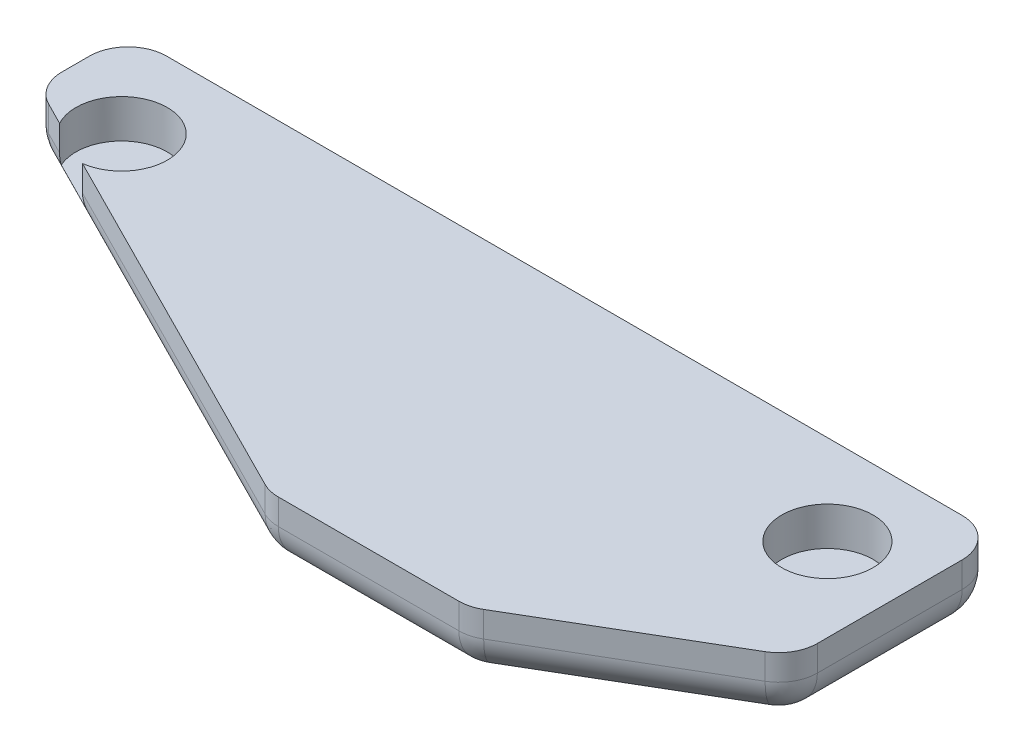
ISO-10303-21;
HEADER;
FILE_DESCRIPTION(('STEP AP214'),'2;1');
FILE_NAME('part.step','',(''),(''),'','','');
FILE_SCHEMA(('AUTOMOTIVE_DESIGN { 1 0 10303 214 1 1 1 1 }'));
ENDSEC;
DATA;
#1=APPLICATION_CONTEXT('core data for automotive mechanical design processes');
#2=APPLICATION_PROTOCOL_DEFINITION('international standard','automotive_design',2000,#1);
#3=PRODUCT_CONTEXT('',#1,'mechanical');
#4=PRODUCT('Part','Part','',(#3));
#5=PRODUCT_RELATED_PRODUCT_CATEGORY('part','',(#4));
#6=PRODUCT_DEFINITION_FORMATION('','',#4);
#7=PRODUCT_DEFINITION_CONTEXT('part definition',#1,'design');
#8=PRODUCT_DEFINITION('design','',#6,#7);
#9=PRODUCT_DEFINITION_SHAPE('','',#8);
#10=(LENGTH_UNIT() NAMED_UNIT(*) SI_UNIT(.MILLI.,.METRE.));
#11=(NAMED_UNIT(*) PLANE_ANGLE_UNIT() SI_UNIT($,.RADIAN.));
#12=(NAMED_UNIT(*) SI_UNIT($,.STERADIAN.) SOLID_ANGLE_UNIT());
#13=UNCERTAINTY_MEASURE_WITH_UNIT(LENGTH_MEASURE(1.E-05),#10,'distance_accuracy_value','');
#14=(GEOMETRIC_REPRESENTATION_CONTEXT(3) GLOBAL_UNCERTAINTY_ASSIGNED_CONTEXT((#13)) GLOBAL_UNIT_ASSIGNED_CONTEXT((#10,
#11,#12)) REPRESENTATION_CONTEXT('',''));
#15=CARTESIAN_POINT('',(0.,0.,0.));
#16=DIRECTION('',(0.,0.,1.));
#17=DIRECTION('',(1.,0.,0.));
#18=AXIS2_PLACEMENT_3D('',#15,#16,#17);
#19=CARTESIAN_POINT('',(-21.2161538362544,2.5,-8.24190342937014));
#20=DIRECTION('',(0.45113218265257,0.,-0.89245714394313));
#21=DIRECTION('',(-0.89245714394313,0.,-0.45113218265257));
#22=AXIS2_PLACEMENT_3D('',#19,#20,#21);
#23=PLANE('',#22);
#24=DIRECTION('',(0.89245714394313,0.,0.45113218265257));
#25=VECTOR('',#24,1.);
#26=CARTESIAN_POINT('',(-21.2161538362544,1.5,-8.24190342937014));
#27=LINE('',#26,#25);
#28=CARTESIAN_POINT('',(-17.7268239757059,1.5,-6.47806635700495));
#29=VERTEX_POINT('',#28);
#30=CARTESIAN_POINT('',(-3.33527557216229,1.5,0.796782286544548));
#31=VERTEX_POINT('',#30);
#32=EDGE_CURVE('E274',#29,#31,#27,.T.);
#33=ORIENTED_EDGE('',*,*,#32,.T.);
#34=DIRECTION('',(0.,-1.,0.));
#35=VECTOR('',#34,1.);
#36=CARTESIAN_POINT('',(-3.33527557216229,2.5,0.796782286544548));
#37=LINE('',#36,#35);
#38=CARTESIAN_POINT('',(-3.33527557216229,2.5,0.79678228654455));
#39=VERTEX_POINT('',#38);
#40=EDGE_CURVE('E277',#31,#39,#37,.F.);
#41=ORIENTED_EDGE('',*,*,#40,.T.);
#42=DIRECTION('',(0.89245714394313,0.,0.45113218265257));
#43=VECTOR('',#42,1.);
#44=CARTESIAN_POINT('',(-21.2161538362544,2.5,-8.24190342937014));
#45=LINE('',#44,#43);
#46=CARTESIAN_POINT('',(-17.7268239757059,2.5,-6.47806635700495));
#47=VERTEX_POINT('',#46);
#48=EDGE_CURVE('E196',#47,#39,#45,.T.);
#49=ORIENTED_EDGE('',*,*,#48,.F.);
#50=DIRECTION('',(0.,1.,0.));
#51=VECTOR('',#50,1.);
#52=CARTESIAN_POINT('',(-17.7268239757059,1.,-6.47806635700495));
#53=LINE('',#52,#51);
#54=EDGE_CURVE('E181',#47,#29,#53,.F.);
#55=ORIENTED_EDGE('',*,*,#54,.T.);
#56=EDGE_LOOP('',(#33,#41,#49,#55));
#57=FACE_BOUND('',#56,.T.);
#58=ADVANCED_FACE('F45',(#57),#23,.F.);
#59=CARTESIAN_POINT('',(-21.2161538362544,2.5,-11.7419034293701));
#60=DIRECTION('',(0.,0.,1.));
#61=DIRECTION('',(1.,0.,0.));
#62=AXIS2_PLACEMENT_3D('',#59,#60,#61);
#63=PLANE('',#62);
#64=DIRECTION('',(-1.,0.,0.));
#65=VECTOR('',#64,1.);
#66=CARTESIAN_POINT('',(-21.2161538362544,2.5,-11.7419034293701));
#67=LINE('',#66,#65);
#68=CARTESIAN_POINT('',(11.2838461637456,2.5,-11.7419034293701));
#69=VERTEX_POINT('',#68);
#70=CARTESIAN_POINT('',(-19.7161538362544,2.5,-11.7419034293701));
#71=VERTEX_POINT('',#70);
#72=EDGE_CURVE('E180',#69,#71,#67,.T.);
#73=ORIENTED_EDGE('',*,*,#72,.F.);
#74=DIRECTION('',(0.,-1.,0.));
#75=VECTOR('',#74,1.);
#76=CARTESIAN_POINT('',(11.2838461637456,2.5,-11.7419034293701));
#77=LINE('',#76,#75);
#78=CARTESIAN_POINT('',(11.2838461637456,1.5,-11.7419034293701));
#79=VERTEX_POINT('',#78);
#80=EDGE_CURVE('E11',#69,#79,#77,.T.);
#81=ORIENTED_EDGE('',*,*,#80,.T.);
#82=DIRECTION('',(-1.,0.,0.));
#83=VECTOR('',#82,1.);
#84=CARTESIAN_POINT('',(-21.2161538362544,1.5,-11.7419034293701));
#85=LINE('',#84,#83);
#86=CARTESIAN_POINT('',(-19.7161538362544,1.5,-11.7419034293701));
#87=VERTEX_POINT('',#86);
#88=EDGE_CURVE('E55',#79,#87,#85,.T.);
#89=ORIENTED_EDGE('',*,*,#88,.T.);
#90=DIRECTION('',(0.,-1.,0.));
#91=VECTOR('',#90,1.);
#92=CARTESIAN_POINT('',(-19.7161538362544,2.5,-11.7419034293701));
#93=LINE('',#92,#91);
#94=EDGE_CURVE('E479',#87,#71,#93,.F.);
#95=ORIENTED_EDGE('',*,*,#94,.T.);
#96=EDGE_LOOP('',(#73,#81,#89,#95));
#97=FACE_BOUND('',#96,.T.);
#98=ADVANCED_FACE('F364',(#97),#63,.F.);
#99=CARTESIAN_POINT('',(-21.2161538362544,2.5,-11.7419034293701));
#100=DIRECTION('',(1.,0.,0.));
#101=DIRECTION('',(0.,0.,-1.));
#102=AXIS2_PLACEMENT_3D('',#99,#100,#101);
#103=PLANE('',#102);
#104=DIRECTION('',(0.,0.,1.));
#105=VECTOR('',#104,1.);
#106=CARTESIAN_POINT('',(-21.2161538362544,1.5,-11.7419034293701));
#107=LINE('',#106,#105);
#108=CARTESIAN_POINT('',(-21.2161538362544,1.5,-10.2419034293701));
#109=VERTEX_POINT('',#108);
#110=CARTESIAN_POINT('',(-21.2161538362544,1.5,-9.16441464641701));
#111=VERTEX_POINT('',#110);
#112=EDGE_CURVE('E283',#109,#111,#107,.T.);
#113=ORIENTED_EDGE('',*,*,#112,.T.);
#114=DIRECTION('',(0.,-1.,0.));
#115=VECTOR('',#114,1.);
#116=CARTESIAN_POINT('',(-21.2161538362544,2.5,-9.16441464641701));
#117=LINE('',#116,#115);
#118=CARTESIAN_POINT('',(-21.2161538362544,2.5,-9.16441464641701));
#119=VERTEX_POINT('',#118);
#120=EDGE_CURVE('E286',#111,#119,#117,.F.);
#121=ORIENTED_EDGE('',*,*,#120,.T.);
#122=DIRECTION('',(0.,0.,1.));
#123=VECTOR('',#122,1.);
#124=CARTESIAN_POINT('',(-21.2161538362544,2.5,-11.7419034293701));
#125=LINE('',#124,#123);
#126=CARTESIAN_POINT('',(-21.2161538362544,2.5,-10.2419034293701));
#127=VERTEX_POINT('',#126);
#128=EDGE_CURVE('E220',#127,#119,#125,.T.);
#129=ORIENTED_EDGE('',*,*,#128,.F.);
#130=DIRECTION('',(0.,-1.,0.));
#131=VECTOR('',#130,1.);
#132=CARTESIAN_POINT('',(-21.2161538362544,2.5,-10.2419034293701));
#133=LINE('',#132,#131);
#134=EDGE_CURVE('E280',#127,#109,#133,.T.);
#135=ORIENTED_EDGE('',*,*,#134,.T.);
#136=EDGE_LOOP('',(#113,#121,#129,#135));
#137=FACE_BOUND('',#136,.T.);
#138=ADVANCED_FACE('F361',(#137),#103,.F.);
#139=DIRECTION('',(0.,-1.,0.));
#140=VECTOR('',#139,1.);
#141=CARTESIAN_POINT('',(-20.3928521102333,2.5,-7.82572893050231));
#142=LINE('',#141,#140);
#143=CARTESIAN_POINT('',(-20.3928521102333,2.5,-7.82572893050231));
#144=VERTEX_POINT('',#143);
#145=CARTESIAN_POINT('',(-20.3928521102333,1.5,-7.82572893050231));
#146=VERTEX_POINT('',#145);
#147=EDGE_CURVE('E269',#144,#146,#142,.T.);
#148=ORIENTED_EDGE('',*,*,#147,.T.);
#149=DIRECTION('',(0.89245714394313,0.,0.45113218265257));
#150=VECTOR('',#149,1.);
#151=CARTESIAN_POINT('',(-21.2161538362544,1.5,-8.24190342937014));
#152=LINE('',#151,#150);
#153=CARTESIAN_POINT('',(-19.5283652972646,1.5,-7.38873559647421));
#154=VERTEX_POINT('',#153);
#155=EDGE_CURVE('E175',#146,#154,#152,.T.);
#156=ORIENTED_EDGE('',*,*,#155,.T.);
#157=DIRECTION('',(0.,1.,0.));
#158=VECTOR('',#157,1.);
#159=CARTESIAN_POINT('',(-19.5283652972646,1.,-7.38873559647421));
#160=LINE('',#159,#158);
#161=CARTESIAN_POINT('',(-19.5283652972646,2.5,-7.38873559647421));
#162=VERTEX_POINT('',#161);
#163=EDGE_CURVE('E169',#154,#162,#160,.T.);
#164=ORIENTED_EDGE('',*,*,#163,.T.);
#165=EDGE_CURVE('E172',#144,#162,#45,.T.);
#166=ORIENTED_EDGE('',*,*,#165,.F.);
#167=EDGE_LOOP('',(#148,#156,#164,#166));
#168=FACE_BOUND('',#167,.T.);
#169=ADVANCED_FACE('F171',(#168),#23,.F.);
#170=CARTESIAN_POINT('',(-3.0161538362544,2.5,0.958096570629853));
#171=DIRECTION('',(0.,0.,-1.));
#172=DIRECTION('',(-1.,0.,0.));
#173=AXIS2_PLACEMENT_3D('',#170,#171,#172);
#174=PLANE('',#173);
#175=DIRECTION('',(1.,0.,0.));
#176=VECTOR('',#175,1.);
#177=CARTESIAN_POINT('',(-3.0161538362544,1.5,0.958096570629853));
#178=LINE('',#177,#176);
#179=CARTESIAN_POINT('',(-2.65857729818344,1.5,0.958096570629853));
#180=VERTEX_POINT('',#179);
#181=CARTESIAN_POINT('',(4.37582391861445,1.5,0.958096570629853));
#182=VERTEX_POINT('',#181);
#183=EDGE_CURVE('E243',#180,#182,#178,.T.);
#184=ORIENTED_EDGE('',*,*,#183,.T.);
#185=DIRECTION('',(0.,-1.,0.));
#186=VECTOR('',#185,1.);
#187=CARTESIAN_POINT('',(4.37582391861445,2.5,0.958096570629853));
#188=LINE('',#187,#186);
#189=CARTESIAN_POINT('',(4.37582391861445,2.5,0.958096570629853));
#190=VERTEX_POINT('',#189);
#191=EDGE_CURVE('E249',#182,#190,#188,.F.);
#192=ORIENTED_EDGE('',*,*,#191,.T.);
#193=DIRECTION('',(1.,0.,0.));
#194=VECTOR('',#193,1.);
#195=CARTESIAN_POINT('',(-3.0161538362544,2.5,0.958096570629853));
#196=LINE('',#195,#194);
#197=CARTESIAN_POINT('',(-2.65857729818344,2.5,0.958096570629853));
#198=VERTEX_POINT('',#197);
#199=EDGE_CURVE('E195',#198,#190,#196,.T.);
#200=ORIENTED_EDGE('',*,*,#199,.F.);
#201=DIRECTION('',(0.,-1.,0.));
#202=VECTOR('',#201,1.);
#203=CARTESIAN_POINT('',(-2.65857729818344,2.5,0.958096570629853));
#204=LINE('',#203,#202);
#205=EDGE_CURVE('E246',#198,#180,#204,.T.);
#206=ORIENTED_EDGE('',*,*,#205,.T.);
#207=EDGE_LOOP('',(#184,#192,#200,#206));
#208=FACE_BOUND('',#207,.T.);
#209=ADVANCED_FACE('F354',(#208),#174,.F.);
#210=CARTESIAN_POINT('',(4.78384616374559,2.5,0.958096570629853));
#211=DIRECTION('',(-0.506549048630865,0.,-0.862211146605729));
#212=DIRECTION('',(-0.862211146605729,0.,0.506549048630865));
#213=AXIS2_PLACEMENT_3D('',#210,#211,#212);
#214=PLANE('',#213);
#215=DIRECTION('',(0.862211146605729,0.,-0.506549048630865));
#216=VECTOR('',#215,1.);
#217=CARTESIAN_POINT('',(4.78384616374559,2.5,0.958096570629853));
#218=LINE('',#217,#216);
#219=CARTESIAN_POINT('',(5.13564749156075,2.5,0.751413290538446));
#220=VERTEX_POINT('',#219);
#221=CARTESIAN_POINT('',(12.0436697366919,2.5,-3.3070497784761));
#222=VERTEX_POINT('',#221);
#223=EDGE_CURVE('E225',#220,#222,#218,.T.);
#224=ORIENTED_EDGE('',*,*,#223,.F.);
#225=DIRECTION('',(0.,-1.,0.));
#226=VECTOR('',#225,1.);
#227=CARTESIAN_POINT('',(5.13564749156075,2.5,0.751413290538446));
#228=LINE('',#227,#226);
#229=CARTESIAN_POINT('',(5.13564749156075,1.5,0.751413290538446));
#230=VERTEX_POINT('',#229);
#231=EDGE_CURVE('E239',#220,#230,#228,.T.);
#232=ORIENTED_EDGE('',*,*,#231,.T.);
#233=DIRECTION('',(0.862211146605729,0.,-0.506549048630865));
#234=VECTOR('',#233,1.);
#235=CARTESIAN_POINT('',(4.78384616374559,1.5,0.958096570629853));
#236=LINE('',#235,#234);
#237=CARTESIAN_POINT('',(12.0436697366919,1.5,-3.3070497784761));
#238=VERTEX_POINT('',#237);
#239=EDGE_CURVE('E236',#230,#238,#236,.T.);
#240=ORIENTED_EDGE('',*,*,#239,.T.);
#241=DIRECTION('',(0.,-1.,0.));
#242=VECTOR('',#241,1.);
#243=CARTESIAN_POINT('',(12.0436697366919,2.5,-3.3070497784761));
#244=LINE('',#243,#242);
#245=EDGE_CURVE('E233',#238,#222,#244,.F.);
#246=ORIENTED_EDGE('',*,*,#245,.T.);
#247=EDGE_LOOP('',(#224,#232,#240,#246));
#248=FACE_BOUND('',#247,.T.);
#249=ADVANCED_FACE('F350',(#248),#214,.F.);
#250=CARTESIAN_POINT('',(12.7838461637456,2.5,-3.74190342937014));
#251=DIRECTION('',(-1.,0.,0.));
#252=DIRECTION('',(0.,0.,1.));
#253=AXIS2_PLACEMENT_3D('',#250,#251,#252);
#254=PLANE('',#253);
#255=DIRECTION('',(0.,0.,-1.));
#256=VECTOR('',#255,1.);
#257=CARTESIAN_POINT('',(12.7838461637456,2.5,-3.74190342937014));
#258=LINE('',#257,#256);
#259=CARTESIAN_POINT('',(12.7838461637456,2.5,-4.60036649838469));
#260=VERTEX_POINT('',#259);
#261=CARTESIAN_POINT('',(12.7838461637456,2.5,-10.2419034293701));
#262=VERTEX_POINT('',#261);
#263=EDGE_CURVE('E229',#260,#262,#258,.T.);
#264=ORIENTED_EDGE('',*,*,#263,.F.);
#265=DIRECTION('',(0.,-1.,0.));
#266=VECTOR('',#265,1.);
#267=CARTESIAN_POINT('',(12.7838461637456,2.5,-4.60036649838469));
#268=LINE('',#267,#266);
#269=CARTESIAN_POINT('',(12.7838461637456,1.5,-4.60036649838469));
#270=VERTEX_POINT('',#269);
#271=EDGE_CURVE('E481',#260,#270,#268,.T.);
#272=ORIENTED_EDGE('',*,*,#271,.T.);
#273=DIRECTION('',(0.,0.,-1.));
#274=VECTOR('',#273,1.);
#275=CARTESIAN_POINT('',(12.7838461637456,1.5,-3.74190342937014));
#276=LINE('',#275,#274);
#277=CARTESIAN_POINT('',(12.7838461637456,1.5,-10.2419034293701));
#278=VERTEX_POINT('',#277);
#279=EDGE_CURVE('E486',#270,#278,#276,.T.);
#280=ORIENTED_EDGE('',*,*,#279,.T.);
#281=DIRECTION('',(0.,-1.,0.));
#282=VECTOR('',#281,1.);
#283=CARTESIAN_POINT('',(12.7838461637456,2.5,-10.2419034293701));
#284=LINE('',#283,#282);
#285=EDGE_CURVE('E526',#278,#262,#284,.F.);
#286=ORIENTED_EDGE('',*,*,#285,.T.);
#287=EDGE_LOOP('',(#264,#272,#280,#286));
#288=FACE_BOUND('',#287,.T.);
#289=ADVANCED_FACE('F344',(#288),#254,.F.);
#290=CARTESIAN_POINT('',(0.,2.5,0.));
#291=DIRECTION('',(0.,1.,0.));
#292=DIRECTION('',(0.,0.,1.));
#293=AXIS2_PLACEMENT_3D('',#290,#291,#292);
#294=PLANE('',#293);
#295=ORIENTED_EDGE('',*,*,#199,.T.);
#296=CARTESIAN_POINT('',(4.37582391861445,2.5,-0.541903429370147));
#297=DIRECTION('',(0.,1.,0.));
#298=DIRECTION('',(0.,0.,1.));
#299=AXIS2_PLACEMENT_3D('',#296,#297,#298);
#300=CIRCLE('',#299,1.5);
#301=EDGE_CURVE('E266',#190,#220,#300,.T.);
#302=ORIENTED_EDGE('',*,*,#301,.T.);
#303=ORIENTED_EDGE('',*,*,#223,.T.);
#304=CARTESIAN_POINT('',(11.2838461637456,2.5,-4.60036649838469));
#305=DIRECTION('',(0.,1.,0.));
#306=DIRECTION('',(0.,0.,1.));
#307=AXIS2_PLACEMENT_3D('',#304,#305,#306);
#308=CIRCLE('',#307,1.5);
#309=EDGE_CURVE('E260',#222,#260,#308,.T.);
#310=ORIENTED_EDGE('',*,*,#309,.T.);
#311=ORIENTED_EDGE('',*,*,#263,.T.);
#312=CARTESIAN_POINT('',(11.2838461637456,2.5,-10.2419034293701));
#313=DIRECTION('',(0.,1.,0.));
#314=DIRECTION('',(0.,0.,1.));
#315=AXIS2_PLACEMENT_3D('',#312,#313,#314);
#316=CIRCLE('',#315,1.5);
#317=EDGE_CURVE('E257',#262,#69,#316,.T.);
#318=ORIENTED_EDGE('',*,*,#317,.T.);
#319=ORIENTED_EDGE('',*,*,#72,.T.);
#320=CARTESIAN_POINT('',(-19.7161538362544,2.5,-10.2419034293701));
#321=DIRECTION('',(0.,1.,0.));
#322=DIRECTION('',(0.,0.,1.));
#323=AXIS2_PLACEMENT_3D('',#320,#321,#322);
#324=CIRCLE('',#323,1.5);
#325=EDGE_CURVE('E252',#71,#127,#324,.T.);
#326=ORIENTED_EDGE('',*,*,#325,.T.);
#327=ORIENTED_EDGE('',*,*,#128,.T.);
#328=CARTESIAN_POINT('',(-19.7161538362544,2.5,-9.16441464641701));
#329=DIRECTION('',(0.,1.,0.));
#330=DIRECTION('',(0.,0.,1.));
#331=AXIS2_PLACEMENT_3D('',#328,#329,#330);
#332=CIRCLE('',#331,1.5);
#333=EDGE_CURVE('E193',#119,#144,#332,.T.);
#334=ORIENTED_EDGE('',*,*,#333,.T.);
#335=ORIENTED_EDGE('',*,*,#165,.T.);
#336=CARTESIAN_POINT('',(-17.9661538362544,2.5,-8.24190342937014));
#337=DIRECTION('',(0.,1.,0.));
#338=DIRECTION('',(0.,0.,1.));
#339=AXIS2_PLACEMENT_3D('',#336,#337,#338);
#340=CIRCLE('',#339,1.78);
#341=EDGE_CURVE('E189',#47,#162,#340,.T.);
#342=ORIENTED_EDGE('',*,*,#341,.F.);
#343=ORIENTED_EDGE('',*,*,#48,.T.);
#344=CARTESIAN_POINT('',(-2.65857729818344,2.5,-0.541903429370147));
#345=DIRECTION('',(0.,1.,0.));
#346=DIRECTION('',(0.,0.,1.));
#347=AXIS2_PLACEMENT_3D('',#344,#345,#346);
#348=CIRCLE('',#347,1.5);
#349=EDGE_CURVE('E263',#39,#198,#348,.T.);
#350=ORIENTED_EDGE('',*,*,#349,.T.);
#351=EDGE_LOOP('',(#295,#302,#303,#310,#311,#318,#319,#326,#327,#334,#335,#342,#343,#350));
#352=FACE_BOUND('',#351,.T.);
#353=CARTESIAN_POINT('',(9.53384616374559,2.5,-8.24190342937015));
#354=DIRECTION('',(0.,1.,0.));
#355=DIRECTION('',(0.,0.,-1.));
#356=AXIS2_PLACEMENT_3D('',#353,#354,#355);
#357=CIRCLE('',#356,1.78);
#358=CARTESIAN_POINT('',(9.53384616374559,2.5,-10.0219034293702));
#359=VERTEX_POINT('',#358);
#360=EDGE_CURVE('E202',#359,#359,#357,.T.);
#361=ORIENTED_EDGE('',*,*,#360,.F.);
#362=EDGE_LOOP('',(#361));
#363=FACE_BOUND('',#362,.T.);
#364=ADVANCED_FACE('F186',(#352,#363),#294,.T.);
#365=CARTESIAN_POINT('',(0.,0.,0.));
#366=DIRECTION('',(0.,1.,0.));
#367=DIRECTION('',(0.,0.,1.));
#368=AXIS2_PLACEMENT_3D('',#365,#366,#367);
#369=PLANE('',#368);
#370=DIRECTION('',(0.89245714394313,0.,0.45113218265257));
#371=VECTOR('',#370,1.);
#372=CARTESIAN_POINT('',(-0.322895239743455,0.,0.638771017753357));
#373=LINE('',#372,#371);
#374=CARTESIAN_POINT('',(-2.65857729818344,0.,-0.541903429370147));
#375=VERTEX_POINT('',#374);
#376=CARTESIAN_POINT('',(-19.7161538362544,0.,-9.16441464641701));
#377=VERTEX_POINT('',#376);
#378=EDGE_CURVE('E301',#375,#377,#373,.F.);
#379=ORIENTED_EDGE('',*,*,#378,.T.);
#380=DIRECTION('',(0.,0.,1.));
#381=VECTOR('',#380,1.);
#382=CARTESIAN_POINT('',(-19.7161538362544,0.,0.));
#383=LINE('',#382,#381);
#384=CARTESIAN_POINT('',(-19.7161538362544,0.,-10.2419034293701));
#385=VERTEX_POINT('',#384);
#386=EDGE_CURVE('E304',#377,#385,#383,.F.);
#387=ORIENTED_EDGE('',*,*,#386,.T.);
#388=DIRECTION('',(-1.,0.,0.));
#389=VECTOR('',#388,1.);
#390=CARTESIAN_POINT('',(0.,0.,-10.2419034293701));
#391=LINE('',#390,#389);
#392=CARTESIAN_POINT('',(11.2838461637456,0.,-10.2419034293701));
#393=VERTEX_POINT('',#392);
#394=EDGE_CURVE('E289',#385,#393,#391,.F.);
#395=ORIENTED_EDGE('',*,*,#394,.T.);
#396=DIRECTION('',(0.,0.,-1.));
#397=VECTOR('',#396,1.);
#398=CARTESIAN_POINT('',(11.2838461637456,0.,0.));
#399=LINE('',#398,#397);
#400=CARTESIAN_POINT('',(11.2838461637456,0.,-4.60036649838469));
#401=VERTEX_POINT('',#400);
#402=EDGE_CURVE('E292',#393,#401,#399,.F.);
#403=ORIENTED_EDGE('',*,*,#402,.T.);
#404=DIRECTION('',(0.862211146605729,0.,-0.506549048630865));
#405=VECTOR('',#404,1.);
#406=CARTESIAN_POINT('',(0.886123608059888,0.,1.50829550308066));
#407=LINE('',#406,#405);
#408=CARTESIAN_POINT('',(4.37582391861446,0.,-0.541903429370147));
#409=VERTEX_POINT('',#408);
#410=EDGE_CURVE('E295',#401,#409,#407,.F.);
#411=ORIENTED_EDGE('',*,*,#410,.T.);
#412=DIRECTION('',(1.,0.,0.));
#413=VECTOR('',#412,1.);
#414=CARTESIAN_POINT('',(0.,0.,-0.541903429370147));
#415=LINE('',#414,#413);
#416=EDGE_CURVE('E298',#409,#375,#415,.F.);
#417=ORIENTED_EDGE('',*,*,#416,.T.);
#418=EDGE_LOOP('',(#379,#387,#395,#403,#411,#417));
#419=FACE_BOUND('',#418,.T.);
#420=ADVANCED_FACE('F337',(#419),#369,.F.);
#421=CARTESIAN_POINT('',(9.53384616374559,1.,-8.24190342937015));
#422=DIRECTION('',(0.,1.,0.));
#423=DIRECTION('',(0.,0.,1.));
#424=AXIS2_PLACEMENT_3D('',#421,#422,#423);
#425=CYLINDRICAL_SURFACE('',#424,1.78);
#426=CARTESIAN_POINT('',(9.53384616374559,1.,-8.24190342937015));
#427=DIRECTION('',(0.,1.,0.));
#428=DIRECTION('',(0.,0.,-1.));
#429=AXIS2_PLACEMENT_3D('',#426,#427,#428);
#430=CIRCLE('',#429,1.78);
#431=CARTESIAN_POINT('',(9.53384616374559,1.,-10.0219034293702));
#432=VERTEX_POINT('',#431);
#433=EDGE_CURVE('E209',#432,#432,#430,.T.);
#434=ORIENTED_EDGE('',*,*,#433,.F.);
#435=EDGE_LOOP('',(#434));
#436=FACE_BOUND('',#435,.T.);
#437=ORIENTED_EDGE('',*,*,#360,.T.);
#438=EDGE_LOOP('',(#437));
#439=FACE_BOUND('',#438,.T.);
#440=ADVANCED_FACE('F332',(#436,#439),#425,.F.);
#441=CARTESIAN_POINT('',(9.53384616374559,1.,-8.24190342937015));
#442=DIRECTION('',(0.,-1.,0.));
#443=DIRECTION('',(0.,0.,-1.));
#444=AXIS2_PLACEMENT_3D('',#441,#442,#443);
#445=PLANE('',#444);
#446=ORIENTED_EDGE('',*,*,#433,.T.);
#447=EDGE_LOOP('',(#446));
#448=FACE_BOUND('',#447,.T.);
#449=ADVANCED_FACE('F336',(#448),#445,.F.);
#450=CARTESIAN_POINT('',(-17.9661538362544,1.,-8.24190342937014));
#451=DIRECTION('',(0.,1.,0.));
#452=DIRECTION('',(0.,0.,1.));
#453=AXIS2_PLACEMENT_3D('',#450,#451,#452);
#454=PLANE('',#453);
#455=CARTESIAN_POINT('',(-17.9661538362544,1.,-8.24190342937014));
#456=DIRECTION('',(0.,1.,0.));
#457=DIRECTION('',(0.,0.,1.));
#458=AXIS2_PLACEMENT_3D('',#455,#456,#457);
#459=CIRCLE('',#458,1.78);
#460=CARTESIAN_POINT('',(-17.5859549230477,1.,-6.50298169841258));
#461=VERTEX_POINT('',#460);
#462=CARTESIAN_POINT('',(-19.5918323042256,1.,-7.5169416932937));
#463=VERTEX_POINT('',#462);
#464=EDGE_CURVE('E201',#461,#463,#459,.T.);
#465=ORIENTED_EDGE('',*,*,#464,.T.);
#466=DIRECTION('',(0.89245714394313,0.,0.45113218265257));
#467=VECTOR('',#466,1.);
#468=CARTESIAN_POINT('',(-19.5918323042256,1.,-7.5169416932937));
#469=LINE('',#468,#467);
#470=EDGE_CURVE('E528',#463,#461,#469,.T.);
#471=ORIENTED_EDGE('',*,*,#470,.T.);
#472=EDGE_LOOP('',(#465,#471));
#473=FACE_BOUND('',#472,.T.);
#474=ADVANCED_FACE('F331',(#473),#454,.T.);
#475=CARTESIAN_POINT('',(-17.9661538362544,1.,-8.24190342937014));
#476=DIRECTION('',(0.,1.,0.));
#477=DIRECTION('',(0.,0.,1.));
#478=AXIS2_PLACEMENT_3D('',#475,#476,#477);
#479=CYLINDRICAL_SURFACE('',#478,1.78);
#480=ORIENTED_EDGE('',*,*,#163,.F.);
#481=CARTESIAN_POINT('',(-19.5283652972646,1.5,-7.38873559647421));
#482=CARTESIAN_POINT('',(-19.5283498465747,1.47074552603865,-7.38872143142233));
#483=CARTESIAN_POINT('',(-19.5290894053926,1.44151983206224,-7.39006104318176));
#484=CARTESIAN_POINT('',(-19.5319444765223,1.38341945308011,-7.39531351335046));
#485=CARTESIAN_POINT('',(-19.5340574915417,1.35454422771325,-7.39922170157816));
#486=CARTESIAN_POINT('',(-19.5421485329608,1.26989717116672,-7.41439562403726));
#487=CARTESIAN_POINT('',(-19.5498898107216,1.21488669993309,-7.42912296226892));
#488=CARTESIAN_POINT('',(-19.5638964373973,1.1338759659634,-7.45721799023324));
#489=CARTESIAN_POINT('',(-19.5690813367443,1.10664643440959,-7.46783375151531));
#490=CARTESIAN_POINT('',(-19.5800646688608,1.05279034263849,-7.49099730337504));
#491=CARTESIAN_POINT('',(-19.5858690438116,1.02617328342096,-7.50356445289218));
#492=CARTESIAN_POINT('',(-19.5918323042256,0.999999999999999,-7.5169416932937));
#493=B_SPLINE_CURVE_WITH_KNOTS('',3,(#481,#482,#483,#484,#485,#486,#487,#488,#489,#490,#491,
#492),.UNSPECIFIED.,.F.,.F.,(4,2,2,2,2,4),(0.,0.0876723938858805,0.175185821325527,
0.346622194866518,0.435616579129443,0.525558069883932),.UNSPECIFIED.);
#494=EDGE_CURVE('E317',#154,#463,#493,.T.);
#495=ORIENTED_EDGE('',*,*,#494,.T.);
#496=ORIENTED_EDGE('',*,*,#464,.F.);
#497=CARTESIAN_POINT('',(-17.5859549230477,1.,-6.50298169841258));
#498=CARTESIAN_POINT('',(-17.6138620441677,1.05088183919257,-6.49688090000058));
#499=CARTESIAN_POINT('',(-17.6389894085062,1.10388191376363,-6.49210111301803));
#500=CARTESIAN_POINT('',(-17.6805497682988,1.21188582704635,-6.48483897854557));
#501=CARTESIAN_POINT('',(-17.6971681678232,1.26681629088524,-6.48230666951094));
#502=CARTESIAN_POINT('',(-17.71454667096,1.35178701982175,-6.47976561987795));
#503=CARTESIAN_POINT('',(-17.7190893853302,1.38102662509103,-6.4791287339435));
#504=CARTESIAN_POINT('',(-17.7252579707664,1.44016870993831,-6.47827846080434));
#505=CARTESIAN_POINT('',(-17.7268483432449,1.47007493545149,-6.47807022443014));
#506=CARTESIAN_POINT('',(-17.7268239757059,1.5,-6.47806635700495));
#507=B_SPLINE_CURVE_WITH_KNOTS('',3,(#497,#498,#499,#500,#501,#502,#503,#504,#505,#506),
.UNSPECIFIED.,.F.,.F.,(4,2,2,2,4),(0.,0.175557698971989,0.3471072241234,0.435749928595007,
0.525451725840333),.UNSPECIFIED.);
#508=EDGE_CURVE('E308',#461,#29,#507,.T.);
#509=ORIENTED_EDGE('',*,*,#508,.T.);
#510=ORIENTED_EDGE('',*,*,#54,.F.);
#511=ORIENTED_EDGE('',*,*,#341,.T.);
#512=EDGE_LOOP('',(#480,#495,#496,#509,#510,#511));
#513=FACE_BOUND('',#512,.T.);
#514=ADVANCED_FACE('F198',(#513),#479,.F.);
#515=CARTESIAN_POINT('',(-19.7161538362544,2.5,-10.2419034293701));
#516=DIRECTION('',(0.,-1.,0.));
#517=DIRECTION('',(0.,0.,-1.));
#518=AXIS2_PLACEMENT_3D('',#515,#516,#517);
#519=CYLINDRICAL_SURFACE('',#518,1.5);
#520=CARTESIAN_POINT('',(-19.7161538362544,1.5,-10.2419034293701));
#521=DIRECTION('',(0.,-1.,0.));
#522=DIRECTION('',(0.,0.,-1.));
#523=AXIS2_PLACEMENT_3D('',#520,#521,#522);
#524=CIRCLE('',#523,1.5);
#525=EDGE_CURVE('E49',#109,#87,#524,.T.);
#526=ORIENTED_EDGE('',*,*,#525,.F.);
#527=ORIENTED_EDGE('',*,*,#134,.F.);
#528=ORIENTED_EDGE('',*,*,#325,.F.);
#529=ORIENTED_EDGE('',*,*,#94,.F.);
#530=EDGE_LOOP('',(#526,#527,#528,#529));
#531=FACE_BOUND('',#530,.T.);
#532=ADVANCED_FACE('F47',(#531),#519,.T.);
#533=CARTESIAN_POINT('',(-19.7161538362544,1.5,-10.2419034293701));
#534=DIRECTION('',(0.,0.,-1.));
#535=DIRECTION('',(-1.,0.,0.));
#536=AXIS2_PLACEMENT_3D('',#533,#534,#535);
#537=SPHERICAL_SURFACE('',#536,1.5);
#538=CARTESIAN_POINT('',(-19.7161538362544,1.5,-10.2419034293701));
#539=DIRECTION('',(0.,0.,-1.));
#540=DIRECTION('',(-1.,0.,0.));
#541=AXIS2_PLACEMENT_3D('',#538,#539,#540);
#542=CIRCLE('',#541,1.5);
#543=EDGE_CURVE('E461',#109,#385,#542,.F.);
#544=ORIENTED_EDGE('',*,*,#543,.F.);
#545=ORIENTED_EDGE('',*,*,#525,.T.);
#546=CARTESIAN_POINT('',(-19.7161538362544,1.5,-10.2419034293701));
#547=DIRECTION('',(-1.,0.,0.));
#548=DIRECTION('',(0.,0.,1.));
#549=AXIS2_PLACEMENT_3D('',#546,#547,#548);
#550=CIRCLE('',#549,1.5);
#551=EDGE_CURVE('E464',#385,#87,#550,.F.);
#552=ORIENTED_EDGE('',*,*,#551,.F.);
#553=EDGE_LOOP('',(#544,#545,#552));
#554=FACE_BOUND('',#553,.T.);
#555=ADVANCED_FACE('F474',(#554),#537,.T.);
#556=CARTESIAN_POINT('',(11.2838461637456,2.5,-10.2419034293701));
#557=DIRECTION('',(0.,-1.,0.));
#558=DIRECTION('',(0.,0.,-1.));
#559=AXIS2_PLACEMENT_3D('',#556,#557,#558);
#560=CYLINDRICAL_SURFACE('',#559,1.5);
#561=ORIENTED_EDGE('',*,*,#317,.F.);
#562=ORIENTED_EDGE('',*,*,#285,.F.);
#563=CARTESIAN_POINT('',(11.2838461637456,1.5,-10.2419034293701));
#564=DIRECTION('',(0.,-1.,0.));
#565=DIRECTION('',(0.,0.,-1.));
#566=AXIS2_PLACEMENT_3D('',#563,#564,#565);
#567=CIRCLE('',#566,1.5);
#568=EDGE_CURVE('E457',#79,#278,#567,.T.);
#569=ORIENTED_EDGE('',*,*,#568,.F.);
#570=ORIENTED_EDGE('',*,*,#80,.F.);
#571=EDGE_LOOP('',(#561,#562,#569,#570));
#572=FACE_BOUND('',#571,.T.);
#573=ADVANCED_FACE('F555',(#572),#560,.T.);
#574=CARTESIAN_POINT('',(-21.2161538362544,1.5,-10.2419034293701));
#575=DIRECTION('',(-1.,0.,0.));
#576=DIRECTION('',(0.,0.,1.));
#577=AXIS2_PLACEMENT_3D('',#574,#575,#576);
#578=CYLINDRICAL_SURFACE('',#577,1.5);
#579=ORIENTED_EDGE('',*,*,#551,.T.);
#580=ORIENTED_EDGE('',*,*,#88,.F.);
#581=CARTESIAN_POINT('',(11.2838461637456,1.5,-10.2419034293701));
#582=DIRECTION('',(1.,0.,0.));
#583=DIRECTION('',(0.,0.,-1.));
#584=AXIS2_PLACEMENT_3D('',#581,#582,#583);
#585=CIRCLE('',#584,1.5);
#586=EDGE_CURVE('E453',#393,#79,#585,.T.);
#587=ORIENTED_EDGE('',*,*,#586,.F.);
#588=ORIENTED_EDGE('',*,*,#394,.F.);
#589=EDGE_LOOP('',(#579,#580,#587,#588));
#590=FACE_BOUND('',#589,.T.);
#591=ADVANCED_FACE('F561',(#590),#578,.T.);
#592=CARTESIAN_POINT('',(-19.7161538362544,1.5,-11.7419034293701));
#593=DIRECTION('',(0.,0.,1.));
#594=DIRECTION('',(1.,0.,0.));
#595=AXIS2_PLACEMENT_3D('',#592,#593,#594);
#596=CYLINDRICAL_SURFACE('',#595,1.5);
#597=ORIENTED_EDGE('',*,*,#543,.T.);
#598=ORIENTED_EDGE('',*,*,#386,.F.);
#599=CARTESIAN_POINT('',(-19.7161538362544,1.5,-9.16441464641701));
#600=DIRECTION('',(0.,0.,1.));
#601=DIRECTION('',(1.,0.,0.));
#602=AXIS2_PLACEMENT_3D('',#599,#600,#601);
#603=CIRCLE('',#602,1.5);
#604=EDGE_CURVE('E449',#111,#377,#603,.T.);
#605=ORIENTED_EDGE('',*,*,#604,.F.);
#606=ORIENTED_EDGE('',*,*,#112,.F.);
#607=EDGE_LOOP('',(#597,#598,#605,#606));
#608=FACE_BOUND('',#607,.T.);
#609=ADVANCED_FACE('F569',(#608),#596,.T.);
#610=CARTESIAN_POINT('',(-19.7161538362544,2.5,-9.16441464641701));
#611=DIRECTION('',(0.,-1.,0.));
#612=DIRECTION('',(0.,0.,-1.));
#613=AXIS2_PLACEMENT_3D('',#610,#611,#612);
#614=CYLINDRICAL_SURFACE('',#613,1.5);
#615=ORIENTED_EDGE('',*,*,#333,.F.);
#616=ORIENTED_EDGE('',*,*,#120,.F.);
#617=CARTESIAN_POINT('',(-19.7161538362544,1.5,-9.16441464641701));
#618=DIRECTION('',(0.,-1.,0.));
#619=DIRECTION('',(0.,0.,-1.));
#620=AXIS2_PLACEMENT_3D('',#617,#618,#619);
#621=CIRCLE('',#620,1.5);
#622=EDGE_CURVE('E445',#146,#111,#621,.T.);
#623=ORIENTED_EDGE('',*,*,#622,.F.);
#624=ORIENTED_EDGE('',*,*,#147,.F.);
#625=EDGE_LOOP('',(#615,#616,#623,#624));
#626=FACE_BOUND('',#625,.T.);
#627=ADVANCED_FACE('F576',(#626),#614,.T.);
#628=CARTESIAN_POINT('',(11.2838461637456,1.5,-10.2419034293701));
#629=DIRECTION('',(0.,0.,-1.));
#630=DIRECTION('',(-1.,0.,0.));
#631=AXIS2_PLACEMENT_3D('',#628,#629,#630);
#632=SPHERICAL_SURFACE('',#631,1.5);
#633=ORIENTED_EDGE('',*,*,#586,.T.);
#634=ORIENTED_EDGE('',*,*,#568,.T.);
#635=CARTESIAN_POINT('',(11.2838461637456,1.5,-10.2419034293701));
#636=DIRECTION('',(0.,0.,-1.));
#637=DIRECTION('',(-1.,0.,0.));
#638=AXIS2_PLACEMENT_3D('',#635,#636,#637);
#639=CIRCLE('',#638,1.5);
#640=EDGE_CURVE('E441',#393,#278,#639,.F.);
#641=ORIENTED_EDGE('',*,*,#640,.F.);
#642=EDGE_LOOP('',(#633,#634,#641));
#643=FACE_BOUND('',#642,.T.);
#644=ADVANCED_FACE('F584',(#643),#632,.T.);
#645=CARTESIAN_POINT('',(-19.7161538362544,1.5,-9.16441464641701));
#646=DIRECTION('',(0.,-1.,0.));
#647=DIRECTION('',(0.,0.,-1.));
#648=AXIS2_PLACEMENT_3D('',#645,#646,#647);
#649=SPHERICAL_SURFACE('',#648,1.5);
#650=ORIENTED_EDGE('',*,*,#622,.T.);
#651=ORIENTED_EDGE('',*,*,#604,.T.);
#652=CARTESIAN_POINT('',(-19.7161538362544,1.5,-9.16441464641701));
#653=DIRECTION('',(-0.892457143943129,0.,-0.451132182652571));
#654=DIRECTION('',(-0.451132182652571,0.,0.892457143943129));
#655=AXIS2_PLACEMENT_3D('',#652,#653,#654);
#656=CIRCLE('',#655,1.5);
#657=EDGE_CURVE('E438',#146,#377,#656,.F.);
#658=ORIENTED_EDGE('',*,*,#657,.F.);
#659=EDGE_LOOP('',(#650,#651,#658));
#660=FACE_BOUND('',#659,.T.);
#661=ADVANCED_FACE('F592',(#660),#649,.T.);
#662=CARTESIAN_POINT('',(11.2838461637456,2.5,-4.60036649838469));
#663=DIRECTION('',(0.,-1.,0.));
#664=DIRECTION('',(0.,0.,-1.));
#665=AXIS2_PLACEMENT_3D('',#662,#663,#664);
#666=CYLINDRICAL_SURFACE('',#665,1.5);
#667=ORIENTED_EDGE('',*,*,#309,.F.);
#668=ORIENTED_EDGE('',*,*,#245,.F.);
#669=CARTESIAN_POINT('',(11.2838461637456,1.5,-4.60036649838469));
#670=DIRECTION('',(0.,-1.,0.));
#671=DIRECTION('',(0.,0.,-1.));
#672=AXIS2_PLACEMENT_3D('',#669,#670,#671);
#673=CIRCLE('',#672,1.5);
#674=EDGE_CURVE('E434',#270,#238,#673,.T.);
#675=ORIENTED_EDGE('',*,*,#674,.F.);
#676=ORIENTED_EDGE('',*,*,#271,.F.);
#677=EDGE_LOOP('',(#667,#668,#675,#676));
#678=FACE_BOUND('',#677,.T.);
#679=ADVANCED_FACE('F516',(#678),#666,.T.);
#680=CARTESIAN_POINT('',(11.2838461637456,1.5,-3.74190342937015));
#681=DIRECTION('',(0.,0.,-1.));
#682=DIRECTION('',(-1.,0.,0.));
#683=AXIS2_PLACEMENT_3D('',#680,#681,#682);
#684=CYLINDRICAL_SURFACE('',#683,1.5);
#685=ORIENTED_EDGE('',*,*,#640,.T.);
#686=ORIENTED_EDGE('',*,*,#279,.F.);
#687=CARTESIAN_POINT('',(11.2838461637456,1.5,-4.60036649838469));
#688=DIRECTION('',(0.,0.,1.));
#689=DIRECTION('',(1.,0.,0.));
#690=AXIS2_PLACEMENT_3D('',#687,#688,#689);
#691=CIRCLE('',#690,1.5);
#692=EDGE_CURVE('E419',#401,#270,#691,.T.);
#693=ORIENTED_EDGE('',*,*,#692,.F.);
#694=ORIENTED_EDGE('',*,*,#402,.F.);
#695=EDGE_LOOP('',(#685,#686,#693,#694));
#696=FACE_BOUND('',#695,.T.);
#697=ADVANCED_FACE('F397',(#696),#684,.T.);
#698=CARTESIAN_POINT('',(-20.5394555622756,1.5,-9.58058914528484));
#699=DIRECTION('',(0.89245714394313,0.,0.45113218265257));
#700=DIRECTION('',(0.45113218265257,0.,-0.89245714394313));
#701=AXIS2_PLACEMENT_3D('',#698,#699,#700);
#702=CYLINDRICAL_SURFACE('',#701,1.5);
#703=ORIENTED_EDGE('',*,*,#657,.T.);
#704=ORIENTED_EDGE('',*,*,#378,.F.);
#705=CARTESIAN_POINT('',(-2.65857729818344,1.5,-0.541903429370147));
#706=DIRECTION('',(0.892457143943129,0.,0.45113218265257));
#707=DIRECTION('',(0.451132182652571,0.,-0.89245714394313));
#708=AXIS2_PLACEMENT_3D('',#705,#706,#707);
#709=CIRCLE('',#708,1.5);
#710=EDGE_CURVE('E415',#31,#375,#709,.T.);
#711=ORIENTED_EDGE('',*,*,#710,.F.);
#712=ORIENTED_EDGE('',*,*,#32,.F.);
#713=ORIENTED_EDGE('',*,*,#508,.F.);
#714=ORIENTED_EDGE('',*,*,#470,.F.);
#715=ORIENTED_EDGE('',*,*,#494,.F.);
#716=ORIENTED_EDGE('',*,*,#155,.F.);
#717=EDGE_LOOP('',(#703,#704,#711,#712,#713,#714,#715,#716));
#718=FACE_BOUND('',#717,.T.);
#719=ADVANCED_FACE('F323',(#718),#702,.T.);
#720=CARTESIAN_POINT('',(-2.65857729818344,2.5,-0.541903429370147));
#721=DIRECTION('',(0.,-1.,0.));
#722=DIRECTION('',(0.,0.,-1.));
#723=AXIS2_PLACEMENT_3D('',#720,#721,#722);
#724=CYLINDRICAL_SURFACE('',#723,1.5);
#725=ORIENTED_EDGE('',*,*,#349,.F.);
#726=ORIENTED_EDGE('',*,*,#40,.F.);
#727=CARTESIAN_POINT('',(-2.65857729818344,1.5,-0.541903429370147));
#728=DIRECTION('',(0.,-1.,0.));
#729=DIRECTION('',(0.,0.,-1.));
#730=AXIS2_PLACEMENT_3D('',#727,#728,#729);
#731=CIRCLE('',#730,1.5);
#732=EDGE_CURVE('E411',#180,#31,#731,.T.);
#733=ORIENTED_EDGE('',*,*,#732,.F.);
#734=ORIENTED_EDGE('',*,*,#205,.F.);
#735=EDGE_LOOP('',(#725,#726,#733,#734));
#736=FACE_BOUND('',#735,.T.);
#737=ADVANCED_FACE('F390',(#736),#724,.T.);
#738=CARTESIAN_POINT('',(11.2838461637456,1.5,-4.60036649838469));
#739=DIRECTION('',(0.,-1.,0.));
#740=DIRECTION('',(0.,0.,-1.));
#741=AXIS2_PLACEMENT_3D('',#738,#739,#740);
#742=SPHERICAL_SURFACE('',#741,1.5);
#743=ORIENTED_EDGE('',*,*,#692,.T.);
#744=ORIENTED_EDGE('',*,*,#674,.T.);
#745=CARTESIAN_POINT('',(11.2838461637456,1.5,-4.60036649838469));
#746=DIRECTION('',(0.862211146605729,0.,-0.506549048630865));
#747=DIRECTION('',(-0.506549048630865,0.,-0.862211146605729));
#748=AXIS2_PLACEMENT_3D('',#745,#746,#747);
#749=CIRCLE('',#748,1.5);
#750=EDGE_CURVE('E424',#401,#238,#749,.F.);
#751=ORIENTED_EDGE('',*,*,#750,.F.);
#752=EDGE_LOOP('',(#743,#744,#751));
#753=FACE_BOUND('',#752,.T.);
#754=ADVANCED_FACE('F387',(#753),#742,.T.);
#755=CARTESIAN_POINT('',(-2.65857729818344,1.5,-0.541903429370147));
#756=DIRECTION('',(0.,-1.,0.));
#757=DIRECTION('',(1.,0.,0.));
#758=AXIS2_PLACEMENT_3D('',#755,#756,#757);
#759=SPHERICAL_SURFACE('',#758,1.5);
#760=ORIENTED_EDGE('',*,*,#732,.T.);
#761=ORIENTED_EDGE('',*,*,#710,.T.);
#762=CARTESIAN_POINT('',(-2.65857729818344,1.5,-0.541903429370147));
#763=DIRECTION('',(-1.,0.,0.));
#764=DIRECTION('',(0.,0.,1.));
#765=AXIS2_PLACEMENT_3D('',#762,#763,#764);
#766=CIRCLE('',#765,1.5);
#767=EDGE_CURVE('E421',#180,#375,#766,.F.);
#768=ORIENTED_EDGE('',*,*,#767,.F.);
#769=EDGE_LOOP('',(#760,#761,#768));
#770=FACE_BOUND('',#769,.T.);
#771=ADVANCED_FACE('F383',(#770),#759,.T.);
#772=CARTESIAN_POINT('',(4.02402259079929,1.5,-0.33522014927874));
#773=DIRECTION('',(0.862211146605729,0.,-0.506549048630865));
#774=DIRECTION('',(-0.506549048630865,0.,-0.862211146605729));
#775=AXIS2_PLACEMENT_3D('',#772,#773,#774);
#776=CYLINDRICAL_SURFACE('',#775,1.5);
#777=ORIENTED_EDGE('',*,*,#750,.T.);
#778=ORIENTED_EDGE('',*,*,#239,.F.);
#779=CARTESIAN_POINT('',(4.37582391861446,1.5,-0.541903429370147));
#780=DIRECTION('',(-0.862211146605729,0.,0.506549048630865));
#781=DIRECTION('',(0.506549048630865,0.,0.862211146605729));
#782=AXIS2_PLACEMENT_3D('',#779,#780,#781);
#783=CIRCLE('',#782,1.5);
#784=EDGE_CURVE('E497',#409,#230,#783,.T.);
#785=ORIENTED_EDGE('',*,*,#784,.F.);
#786=ORIENTED_EDGE('',*,*,#410,.F.);
#787=EDGE_LOOP('',(#777,#778,#785,#786));
#788=FACE_BOUND('',#787,.T.);
#789=ADVANCED_FACE('F379',(#788),#776,.T.);
#790=CARTESIAN_POINT('',(-3.0161538362544,1.5,-0.541903429370147));
#791=DIRECTION('',(1.,0.,0.));
#792=DIRECTION('',(0.,0.,-1.));
#793=AXIS2_PLACEMENT_3D('',#790,#791,#792);
#794=CYLINDRICAL_SURFACE('',#793,1.5);
#795=ORIENTED_EDGE('',*,*,#767,.T.);
#796=ORIENTED_EDGE('',*,*,#416,.F.);
#797=CARTESIAN_POINT('',(4.37582391861445,1.5,-0.541903429370147));
#798=DIRECTION('',(1.,0.,0.));
#799=DIRECTION('',(0.,1.,0.));
#800=AXIS2_PLACEMENT_3D('',#797,#798,#799);
#801=CIRCLE('',#800,1.5);
#802=EDGE_CURVE('E493',#182,#409,#801,.T.);
#803=ORIENTED_EDGE('',*,*,#802,.F.);
#804=ORIENTED_EDGE('',*,*,#183,.F.);
#805=EDGE_LOOP('',(#795,#796,#803,#804));
#806=FACE_BOUND('',#805,.T.);
#807=ADVANCED_FACE('F375',(#806),#794,.T.);
#808=CARTESIAN_POINT('',(4.37582391861445,1.5,-0.541903429370147));
#809=DIRECTION('',(0.,-1.,0.));
#810=DIRECTION('',(1.,0.,0.));
#811=AXIS2_PLACEMENT_3D('',#808,#809,#810);
#812=SPHERICAL_SURFACE('',#811,1.5);
#813=ORIENTED_EDGE('',*,*,#802,.T.);
#814=ORIENTED_EDGE('',*,*,#784,.T.);
#815=CARTESIAN_POINT('',(4.37582391861445,1.5,-0.541903429370147));
#816=DIRECTION('',(0.,-1.,0.));
#817=DIRECTION('',(0.,0.,-1.));
#818=AXIS2_PLACEMENT_3D('',#815,#816,#817);
#819=CIRCLE('',#818,1.5);
#820=EDGE_CURVE('E490',#182,#230,#819,.F.);
#821=ORIENTED_EDGE('',*,*,#820,.F.);
#822=EDGE_LOOP('',(#813,#814,#821));
#823=FACE_BOUND('',#822,.T.);
#824=ADVANCED_FACE('F371',(#823),#812,.T.);
#825=CARTESIAN_POINT('',(4.37582391861445,2.5,-0.541903429370147));
#826=DIRECTION('',(0.,-1.,0.));
#827=DIRECTION('',(0.,0.,-1.));
#828=AXIS2_PLACEMENT_3D('',#825,#826,#827);
#829=CYLINDRICAL_SURFACE('',#828,1.5);
#830=ORIENTED_EDGE('',*,*,#301,.F.);
#831=ORIENTED_EDGE('',*,*,#191,.F.);
#832=ORIENTED_EDGE('',*,*,#820,.T.);
#833=ORIENTED_EDGE('',*,*,#231,.F.);
#834=EDGE_LOOP('',(#830,#831,#832,#833));
#835=FACE_BOUND('',#834,.T.);
#836=ADVANCED_FACE('F368',(#835),#829,.T.);
#837=CLOSED_SHELL('',(#58,#98,#138,#169,#209,#249,#289,#364,#420,#440,#449,#474,#514,#532,#555,
#573,#591,#609,#627,#644,#661,#679,#697,#719,#737,#754,#771,#789,#807,#824,#836));
#838=MANIFOLD_SOLID_BREP('B2',#837);
#839=ADVANCED_BREP_SHAPE_REPRESENTATION('',(#18,#838),#14);
#840=SHAPE_DEFINITION_REPRESENTATION(#9,#839);
ENDSEC;
END-ISO-10303-21;
